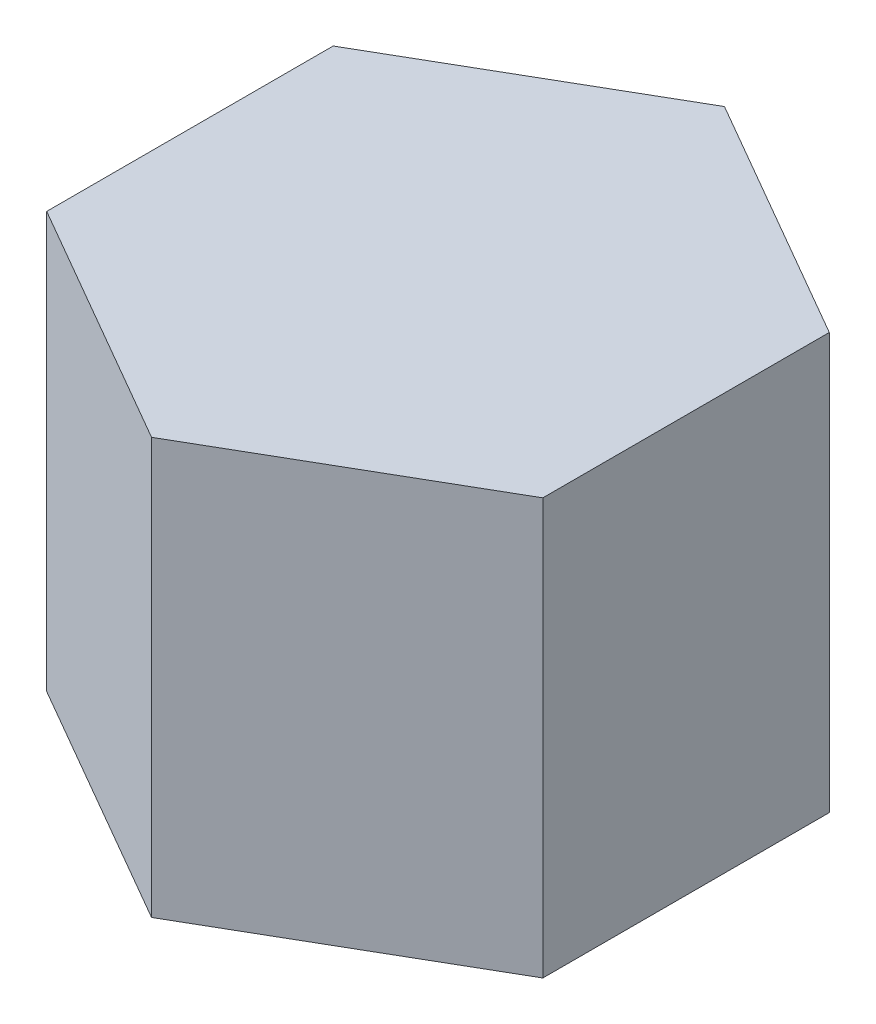
ISO-10303-21;
HEADER;
FILE_DESCRIPTION(('STEP AP214'),'2;1');
FILE_NAME('part.step','',(''),(''),'','','');
FILE_SCHEMA(('AUTOMOTIVE_DESIGN { 1 0 10303 214 1 1 1 1 }'));
ENDSEC;
DATA;
#1=APPLICATION_CONTEXT('core data for automotive mechanical design processes');
#2=APPLICATION_PROTOCOL_DEFINITION('international standard','automotive_design',2000,#1);
#3=PRODUCT_CONTEXT('',#1,'mechanical');
#4=PRODUCT('Part','Part','',(#3));
#5=PRODUCT_RELATED_PRODUCT_CATEGORY('part','',(#4));
#6=PRODUCT_DEFINITION_FORMATION('','',#4);
#7=PRODUCT_DEFINITION_CONTEXT('part definition',#1,'design');
#8=PRODUCT_DEFINITION('design','',#6,#7);
#9=PRODUCT_DEFINITION_SHAPE('','',#8);
#10=(LENGTH_UNIT() NAMED_UNIT(*) SI_UNIT(.MILLI.,.METRE.));
#11=(NAMED_UNIT(*) PLANE_ANGLE_UNIT() SI_UNIT($,.RADIAN.));
#12=(NAMED_UNIT(*) SI_UNIT($,.STERADIAN.) SOLID_ANGLE_UNIT());
#13=UNCERTAINTY_MEASURE_WITH_UNIT(LENGTH_MEASURE(1.E-05),#10,'distance_accuracy_value','');
#14=(GEOMETRIC_REPRESENTATION_CONTEXT(3) GLOBAL_UNCERTAINTY_ASSIGNED_CONTEXT((#13)) GLOBAL_UNIT_ASSIGNED_CONTEXT((#10,
#11,#12)) REPRESENTATION_CONTEXT('',''));
#15=CARTESIAN_POINT('',(0.,0.,0.));
#16=DIRECTION('',(0.,0.,1.));
#17=DIRECTION('',(1.,0.,0.));
#18=AXIS2_PLACEMENT_3D('',#15,#16,#17);
#19=CARTESIAN_POINT('',(203.142660308706,-148.537700895744,288.908895009141));
#20=DIRECTION('',(-0.499999999999943,0.,-0.866025403784472));
#21=DIRECTION('',(-0.866025403784472,0.,0.499999999999943));
#22=AXIS2_PLACEMENT_3D('',#19,#20,#21);
#23=PLANE('',#22);
#24=CARTESIAN_POINT('',(202.839551417382,-149.045793579175,289.083895009141));
#25=DIRECTION('',(0.866025403784471,0.,-0.499999999999943));
#26=VECTOR('',#25,1.);
#27=LINE('',#24,#26);
#28=CARTESIAN_POINT('',(202.839551417382,-149.045793579175,289.083895009141));
#29=VERTEX_POINT('',#28);
#30=CARTESIAN_POINT('',(203.142660308706,-149.045793579175,288.908895009141));
#31=VERTEX_POINT('',#30);
#32=EDGE_CURVE('E170',#29,#31,#27,.T.);
#33=ORIENTED_EDGE('',*,*,#32,.T.);
#34=CARTESIAN_POINT('',(203.142660308706,-148.537700895744,288.908895009141));
#35=DIRECTION('',(0.,-1.,0.));
#36=VECTOR('',#35,1.);
#37=LINE('',#34,#36);
#38=CARTESIAN_POINT('',(203.142660308706,-148.537700895744,288.908895009141));
#39=VERTEX_POINT('',#38);
#40=EDGE_CURVE('E35',#39,#31,#37,.T.);
#41=ORIENTED_EDGE('',*,*,#40,.F.);
#42=CARTESIAN_POINT('',(202.839551417382,-148.537700895744,289.083895009141));
#43=DIRECTION('',(0.866025403784471,0.,-0.499999999999943));
#44=VECTOR('',#43,1.);
#45=LINE('',#42,#44);
#46=CARTESIAN_POINT('',(202.839551417382,-148.537700895744,289.083895009141));
#47=VERTEX_POINT('',#46);
#48=EDGE_CURVE('E159',#47,#39,#45,.T.);
#49=ORIENTED_EDGE('',*,*,#48,.F.);
#50=CARTESIAN_POINT('',(202.839551417382,-148.537700895744,289.083895009141));
#51=DIRECTION('',(0.,-1.,0.));
#52=VECTOR('',#51,1.);
#53=LINE('',#50,#52);
#54=EDGE_CURVE('E10',#47,#29,#53,.T.);
#55=ORIENTED_EDGE('',*,*,#54,.T.);
#56=EDGE_LOOP('',(#33,#41,#49,#55));
#57=FACE_BOUND('',#56,.T.);
#58=ADVANCED_FACE('F16',(#57),#23,.F.);
#59=CARTESIAN_POINT('',(202.839551417382,-148.537700895744,289.083895009141));
#60=DIRECTION('',(0.500000000000062,0.,-0.866025403784403));
#61=DIRECTION('',(-0.866025403784403,0.,-0.500000000000062));
#62=AXIS2_PLACEMENT_3D('',#59,#60,#61);
#63=PLANE('',#62);
#64=CARTESIAN_POINT('',(202.536442526057,-149.045793579175,288.908895009141));
#65=DIRECTION('',(0.866025403784403,0.,0.500000000000062));
#66=VECTOR('',#65,1.);
#67=LINE('',#64,#66);
#68=CARTESIAN_POINT('',(202.536442526057,-149.045793579175,288.908895009141));
#69=VERTEX_POINT('',#68);
#70=EDGE_CURVE('E167',#69,#29,#67,.T.);
#71=ORIENTED_EDGE('',*,*,#70,.T.);
#72=ORIENTED_EDGE('',*,*,#54,.F.);
#73=CARTESIAN_POINT('',(202.536442526057,-148.537700895744,288.908895009141));
#74=DIRECTION('',(0.866025403784403,0.,0.500000000000062));
#75=VECTOR('',#74,1.);
#76=LINE('',#73,#75);
#77=CARTESIAN_POINT('',(202.536442526057,-148.537700895744,288.908895009141));
#78=VERTEX_POINT('',#77);
#79=EDGE_CURVE('E156',#78,#47,#76,.T.);
#80=ORIENTED_EDGE('',*,*,#79,.F.);
#81=CARTESIAN_POINT('',(202.536442526057,-148.537700895744,288.908895009141));
#82=DIRECTION('',(0.,-1.,0.));
#83=VECTOR('',#82,1.);
#84=LINE('',#81,#83);
#85=EDGE_CURVE('E27',#78,#69,#84,.T.);
#86=ORIENTED_EDGE('',*,*,#85,.T.);
#87=EDGE_LOOP('',(#71,#72,#80,#86));
#88=FACE_BOUND('',#87,.T.);
#89=ADVANCED_FACE('F189',(#88),#63,.F.);
#90=CARTESIAN_POINT('',(202.536442526057,-148.537700895744,290.831971220494));
#91=DIRECTION('',(1.,0.,0.));
#92=DIRECTION('',(0.,1.,0.));
#93=AXIS2_PLACEMENT_3D('',#90,#91,#92);
#94=PLANE('',#93);
#95=CARTESIAN_POINT('',(202.536442526057,-149.045793579175,288.558895009141));
#96=DIRECTION('',(0.,0.,1.));
#97=VECTOR('',#96,1.);
#98=LINE('',#95,#97);
#99=CARTESIAN_POINT('',(202.536442526057,-149.045793579175,288.558895009141));
#100=VERTEX_POINT('',#99);
#101=EDGE_CURVE('E163',#100,#69,#98,.T.);
#102=ORIENTED_EDGE('',*,*,#101,.T.);
#103=ORIENTED_EDGE('',*,*,#85,.F.);
#104=CARTESIAN_POINT('',(202.536442526057,-148.537700895744,288.558895009141));
#105=DIRECTION('',(0.,0.,1.));
#106=VECTOR('',#105,1.);
#107=LINE('',#104,#106);
#108=CARTESIAN_POINT('',(202.536442526057,-148.537700895744,288.558895009141));
#109=VERTEX_POINT('',#108);
#110=EDGE_CURVE('E106',#109,#78,#107,.T.);
#111=ORIENTED_EDGE('',*,*,#110,.F.);
#112=CARTESIAN_POINT('',(202.536442526057,-148.537700895744,288.558895009141));
#113=DIRECTION('',(0.,-1.,0.));
#114=VECTOR('',#113,1.);
#115=LINE('',#112,#114);
#116=EDGE_CURVE('E94',#109,#100,#115,.T.);
#117=ORIENTED_EDGE('',*,*,#116,.T.);
#118=EDGE_LOOP('',(#102,#103,#111,#117));
#119=FACE_BOUND('',#118,.T.);
#120=ADVANCED_FACE('F198',(#119),#94,.F.);
#121=CARTESIAN_POINT('',(202.536442526057,-148.537700895744,288.558895009141));
#122=DIRECTION('',(0.499999999999978,0.,0.866025403784452));
#123=DIRECTION('',(0.866025403784452,0.,-0.499999999999978));
#124=AXIS2_PLACEMENT_3D('',#121,#122,#123);
#125=PLANE('',#124);
#126=CARTESIAN_POINT('',(202.839551417382,-149.045793579175,288.383895009141));
#127=DIRECTION('',(-0.866025403784452,0.,0.499999999999978));
#128=VECTOR('',#127,1.);
#129=LINE('',#126,#128);
#130=CARTESIAN_POINT('',(202.839551417382,-149.045793579175,288.383895009141));
#131=VERTEX_POINT('',#130);
#132=EDGE_CURVE('E162',#131,#100,#129,.T.);
#133=ORIENTED_EDGE('',*,*,#132,.T.);
#134=ORIENTED_EDGE('',*,*,#116,.F.);
#135=CARTESIAN_POINT('',(202.839551417382,-148.537700895744,288.383895009141));
#136=DIRECTION('',(-0.866025403784452,0.,0.499999999999978));
#137=VECTOR('',#136,1.);
#138=LINE('',#135,#137);
#139=CARTESIAN_POINT('',(202.839551417382,-148.537700895744,288.383895009141));
#140=VERTEX_POINT('',#139);
#141=EDGE_CURVE('E98',#140,#109,#138,.T.);
#142=ORIENTED_EDGE('',*,*,#141,.F.);
#143=CARTESIAN_POINT('',(202.839551417382,-148.537700895744,288.383895009141));
#144=DIRECTION('',(0.,-1.,0.));
#145=VECTOR('',#144,1.);
#146=LINE('',#143,#145);
#147=EDGE_CURVE('E79',#140,#131,#146,.T.);
#148=ORIENTED_EDGE('',*,*,#147,.T.);
#149=EDGE_LOOP('',(#133,#134,#142,#148));
#150=FACE_BOUND('',#149,.T.);
#151=ADVANCED_FACE('F100',(#150),#125,.F.);
#152=CARTESIAN_POINT('',(202.839551417382,-148.537700895744,288.383895009141));
#153=DIRECTION('',(-0.499999999999978,0.,0.866025403784452));
#154=DIRECTION('',(0.866025403784452,0.,0.499999999999978));
#155=AXIS2_PLACEMENT_3D('',#152,#153,#154);
#156=PLANE('',#155);
#157=CARTESIAN_POINT('',(203.142660308706,-149.045793579175,288.558895009141));
#158=DIRECTION('',(-0.866025403784452,0.,-0.499999999999978));
#159=VECTOR('',#158,1.);
#160=LINE('',#157,#159);
#161=CARTESIAN_POINT('',(203.142660308706,-149.045793579175,288.558895009141));
#162=VERTEX_POINT('',#161);
#163=EDGE_CURVE('E88',#162,#131,#160,.T.);
#164=ORIENTED_EDGE('',*,*,#163,.T.);
#165=ORIENTED_EDGE('',*,*,#147,.F.);
#166=CARTESIAN_POINT('',(203.142660308706,-148.537700895744,288.558895009141));
#167=DIRECTION('',(-0.866025403784452,0.,-0.499999999999978));
#168=VECTOR('',#167,1.);
#169=LINE('',#166,#168);
#170=CARTESIAN_POINT('',(203.142660308706,-148.537700895744,288.558895009141));
#171=VERTEX_POINT('',#170);
#172=EDGE_CURVE('E84',#171,#140,#169,.T.);
#173=ORIENTED_EDGE('',*,*,#172,.F.);
#174=CARTESIAN_POINT('',(203.142660308706,-148.537700895744,288.558895009141));
#175=DIRECTION('',(0.,-1.,0.));
#176=VECTOR('',#175,1.);
#177=LINE('',#174,#176);
#178=EDGE_CURVE('E58',#171,#162,#177,.T.);
#179=ORIENTED_EDGE('',*,*,#178,.T.);
#180=EDGE_LOOP('',(#164,#165,#173,#179));
#181=FACE_BOUND('',#180,.T.);
#182=ADVANCED_FACE('F82',(#181),#156,.F.);
#183=CARTESIAN_POINT('',(203.142660308706,-148.537700895744,290.831971220494));
#184=DIRECTION('',(-1.,0.,0.));
#185=DIRECTION('',(0.,-1.,0.));
#186=AXIS2_PLACEMENT_3D('',#183,#184,#185);
#187=PLANE('',#186);
#188=CARTESIAN_POINT('',(203.142660308706,-149.045793579175,288.908895009141));
#189=DIRECTION('',(0.,0.,-1.));
#190=VECTOR('',#189,1.);
#191=LINE('',#188,#190);
#192=EDGE_CURVE('E160',#31,#162,#191,.T.);
#193=ORIENTED_EDGE('',*,*,#192,.T.);
#194=ORIENTED_EDGE('',*,*,#178,.F.);
#195=CARTESIAN_POINT('',(203.142660308706,-148.537700895744,288.908895009141));
#196=DIRECTION('',(0.,0.,-1.));
#197=VECTOR('',#196,1.);
#198=LINE('',#195,#197);
#199=EDGE_CURVE('E112',#39,#171,#198,.T.);
#200=ORIENTED_EDGE('',*,*,#199,.F.);
#201=ORIENTED_EDGE('',*,*,#40,.T.);
#202=EDGE_LOOP('',(#193,#194,#200,#201));
#203=FACE_BOUND('',#202,.T.);
#204=ADVANCED_FACE('F131',(#203),#187,.F.);
#205=CARTESIAN_POINT('',(206.339551417382,-148.537700895744,290.831971220494));
#206=DIRECTION('',(0.,-1.,0.));
#207=DIRECTION('',(1.,0.,0.));
#208=AXIS2_PLACEMENT_3D('',#205,#206,#207);
#209=PLANE('',#208);
#210=ORIENTED_EDGE('',*,*,#48,.T.);
#211=ORIENTED_EDGE('',*,*,#199,.T.);
#212=ORIENTED_EDGE('',*,*,#172,.T.);
#213=ORIENTED_EDGE('',*,*,#141,.T.);
#214=ORIENTED_EDGE('',*,*,#110,.T.);
#215=ORIENTED_EDGE('',*,*,#79,.T.);
#216=EDGE_LOOP('',(#210,#211,#212,#213,#214,#215));
#217=FACE_BOUND('',#216,.T.);
#218=ADVANCED_FACE('F111',(#217),#209,.F.);
#219=CARTESIAN_POINT('',(206.339551417382,-149.045793579175,290.831971220494));
#220=DIRECTION('',(0.,-1.,0.));
#221=DIRECTION('',(1.,0.,0.));
#222=AXIS2_PLACEMENT_3D('',#219,#220,#221);
#223=PLANE('',#222);
#224=ORIENTED_EDGE('',*,*,#32,.F.);
#225=ORIENTED_EDGE('',*,*,#70,.F.);
#226=ORIENTED_EDGE('',*,*,#101,.F.);
#227=ORIENTED_EDGE('',*,*,#132,.F.);
#228=ORIENTED_EDGE('',*,*,#163,.F.);
#229=ORIENTED_EDGE('',*,*,#192,.F.);
#230=EDGE_LOOP('',(#224,#225,#226,#227,#228,#229));
#231=FACE_BOUND('',#230,.T.);
#232=ADVANCED_FACE('F130',(#231),#223,.T.);
#233=CLOSED_SHELL('',(#58,#89,#120,#151,#182,#204,#218,#232));
#234=MANIFOLD_SOLID_BREP('B1',#233);
#235=ADVANCED_BREP_SHAPE_REPRESENTATION('',(#18,#234),#14);
#236=SHAPE_DEFINITION_REPRESENTATION(#9,#235);
ENDSEC;
END-ISO-10303-21;
